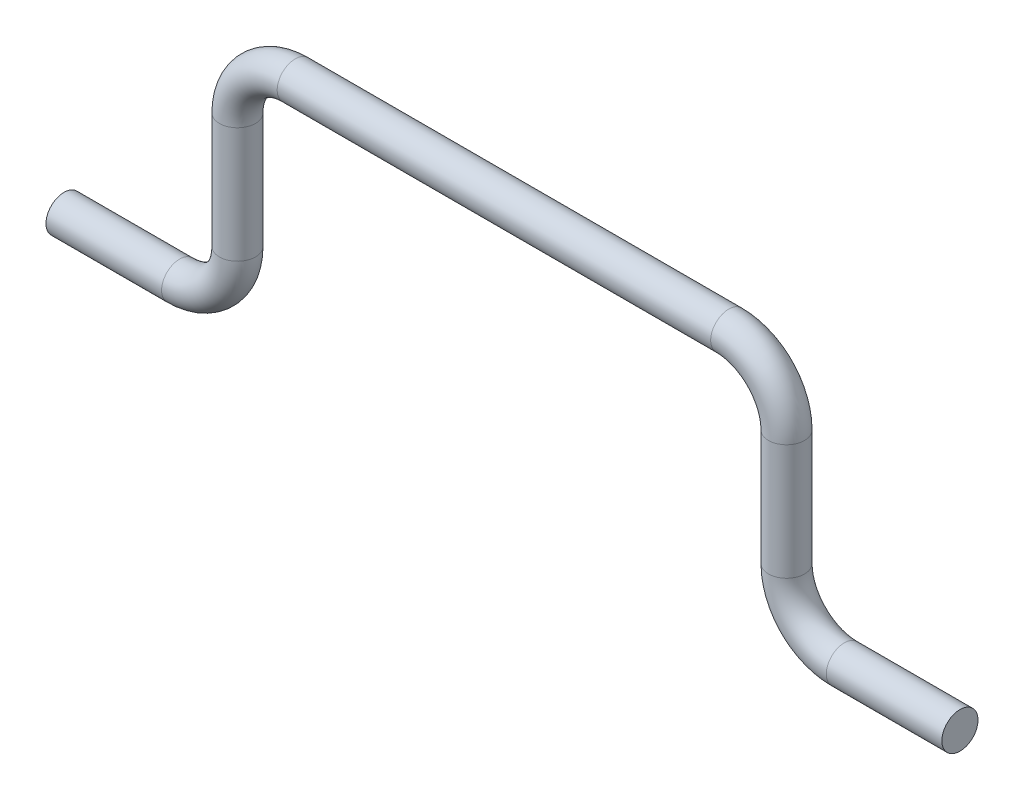
ISO-10303-21;
HEADER;
FILE_DESCRIPTION(('STEP AP214'),'2;1');
FILE_NAME('part.step','',(''),(''),'','','');
FILE_SCHEMA(('AUTOMOTIVE_DESIGN { 1 0 10303 214 1 1 1 1 }'));
ENDSEC;
DATA;
#1=APPLICATION_CONTEXT('core data for automotive mechanical design processes');
#2=APPLICATION_PROTOCOL_DEFINITION('international standard','automotive_design',2000,#1);
#3=PRODUCT_CONTEXT('',#1,'mechanical');
#4=PRODUCT('Part','Part','',(#3));
#5=PRODUCT_RELATED_PRODUCT_CATEGORY('part','',(#4));
#6=PRODUCT_DEFINITION_FORMATION('','',#4);
#7=PRODUCT_DEFINITION_CONTEXT('part definition',#1,'design');
#8=PRODUCT_DEFINITION('design','',#6,#7);
#9=PRODUCT_DEFINITION_SHAPE('','',#8);
#10=(LENGTH_UNIT() NAMED_UNIT(*) SI_UNIT(.MILLI.,.METRE.));
#11=(NAMED_UNIT(*) PLANE_ANGLE_UNIT() SI_UNIT($,.RADIAN.));
#12=(NAMED_UNIT(*) SI_UNIT($,.STERADIAN.) SOLID_ANGLE_UNIT());
#13=UNCERTAINTY_MEASURE_WITH_UNIT(LENGTH_MEASURE(1.E-05),#10,'distance_accuracy_value','');
#14=(GEOMETRIC_REPRESENTATION_CONTEXT(3) GLOBAL_UNCERTAINTY_ASSIGNED_CONTEXT((#13)) GLOBAL_UNIT_ASSIGNED_CONTEXT((#10,
#11,#12)) REPRESENTATION_CONTEXT('',''));
#15=CARTESIAN_POINT('',(0.,0.,0.));
#16=DIRECTION('',(0.,0.,1.));
#17=DIRECTION('',(1.,0.,0.));
#18=AXIS2_PLACEMENT_3D('',#15,#16,#17);
#19=CARTESIAN_POINT('',(196.85,0.,0.));
#20=DIRECTION('',(1.,0.,0.));
#21=DIRECTION('',(0.,0.,-1.));
#22=AXIS2_PLACEMENT_3D('',#19,#20,#21);
#23=PLANE('',#22);
#24=CARTESIAN_POINT('',(196.85,0.,0.));
#25=DIRECTION('',(1.,0.,0.));
#26=DIRECTION('',(0.,0.,-1.));
#27=AXIS2_PLACEMENT_3D('',#24,#25,#26);
#28=CIRCLE('',#27,3.96875);
#29=CARTESIAN_POINT('',(196.85,0.,-3.96875));
#30=VERTEX_POINT('',#29);
#31=EDGE_CURVE('E86',#30,#30,#28,.T.);
#32=ORIENTED_EDGE('',*,*,#31,.T.);
#33=EDGE_LOOP('',(#32));
#34=FACE_BOUND('',#33,.T.);
#35=ADVANCED_FACE('F43',(#34),#23,.T.);
#36=CARTESIAN_POINT('',(0.,0.,0.));
#37=DIRECTION('',(1.,0.,0.));
#38=DIRECTION('',(0.,0.,-1.));
#39=AXIS2_PLACEMENT_3D('',#36,#37,#38);
#40=PLANE('',#39);
#41=CARTESIAN_POINT('',(0.,0.,0.));
#42=DIRECTION('',(1.,0.,0.));
#43=DIRECTION('',(0.,0.,-1.));
#44=AXIS2_PLACEMENT_3D('',#41,#42,#43);
#45=CIRCLE('',#44,3.96875);
#46=CARTESIAN_POINT('',(0.,0.,-3.96875));
#47=VERTEX_POINT('',#46);
#48=EDGE_CURVE('E10',#47,#47,#45,.T.);
#49=ORIENTED_EDGE('',*,*,#48,.F.);
#50=EDGE_LOOP('',(#49));
#51=FACE_BOUND('',#50,.T.);
#52=ADVANCED_FACE('F95',(#51),#40,.F.);
#53=CARTESIAN_POINT('',(196.85,0.,0.));
#54=DIRECTION('',(-1.,0.,0.));
#55=DIRECTION('',(0.,-1.,0.));
#56=AXIS2_PLACEMENT_3D('',#53,#54,#55);
#57=CYLINDRICAL_SURFACE('',#56,3.96875);
#58=CARTESIAN_POINT('',(171.45,0.,0.));
#59=DIRECTION('',(1.,0.,0.));
#60=DIRECTION('',(0.,0.,-1.));
#61=AXIS2_PLACEMENT_3D('',#58,#59,#60);
#62=CIRCLE('',#61,3.96875);
#63=CARTESIAN_POINT('',(171.45,-3.96874999999998,0.));
#64=VERTEX_POINT('',#63);
#65=EDGE_CURVE('E82',#64,#64,#62,.T.);
#66=ORIENTED_EDGE('',*,*,#65,.T.);
#67=EDGE_LOOP('',(#66));
#68=FACE_BOUND('',#67,.T.);
#69=ORIENTED_EDGE('',*,*,#31,.F.);
#70=EDGE_LOOP('',(#69));
#71=FACE_BOUND('',#70,.T.);
#72=ADVANCED_FACE('F92',(#68,#71),#57,.T.);
#73=CARTESIAN_POINT('',(171.45,12.7,0.));
#74=DIRECTION('',(0.,0.,-1.));
#75=DIRECTION('',(-1.,0.,0.));
#76=AXIS2_PLACEMENT_3D('',#73,#74,#75);
#77=TOROIDAL_SURFACE('',#76,12.7,3.96875);
#78=CARTESIAN_POINT('',(158.75,12.7,0.));
#79=DIRECTION('',(0.,-1.,0.));
#80=DIRECTION('',(0.,0.,-1.));
#81=AXIS2_PLACEMENT_3D('',#78,#79,#80);
#82=CIRCLE('',#81,3.96875);
#83=CARTESIAN_POINT('',(154.78125,12.7,0.));
#84=VERTEX_POINT('',#83);
#85=EDGE_CURVE('E78',#84,#84,#82,.T.);
#86=CARTESIAN_POINT('',(171.45,12.7,0.));
#87=DIRECTION('',(0.,0.,-1.));
#88=DIRECTION('',(-1.,0.,0.));
#89=AXIS2_PLACEMENT_3D('',#86,#87,#88);
#90=CIRCLE('',#89,16.66875);
#91=EDGE_CURVE('',#64,#84,#90,.T.);
#92=ORIENTED_EDGE('',*,*,#65,.F.);
#93=ORIENTED_EDGE('',*,*,#85,.T.);
#94=ORIENTED_EDGE('',*,*,#91,.T.);
#95=ORIENTED_EDGE('',*,*,#91,.F.);
#96=EDGE_LOOP('',(#92,#94,#93,#95));
#97=FACE_BOUND('',#96,.T.);
#98=ADVANCED_FACE('F94',(#97),#77,.T.);
#99=CARTESIAN_POINT('',(158.75,12.7000000000001,0.));
#100=DIRECTION('',(0.,1.,0.));
#101=DIRECTION('',(0.,0.,1.));
#102=AXIS2_PLACEMENT_3D('',#99,#100,#101);
#103=CYLINDRICAL_SURFACE('',#102,3.96875);
#104=CARTESIAN_POINT('',(158.75,38.0999999999999,0.));
#105=DIRECTION('',(0.,-1.,0.));
#106=DIRECTION('',(0.,0.,-1.));
#107=AXIS2_PLACEMENT_3D('',#104,#105,#106);
#108=CIRCLE('',#107,3.96875);
#109=CARTESIAN_POINT('',(162.71875,38.0999999999999,0.));
#110=VERTEX_POINT('',#109);
#111=EDGE_CURVE('E74',#110,#110,#108,.T.);
#112=ORIENTED_EDGE('',*,*,#111,.T.);
#113=EDGE_LOOP('',(#112));
#114=FACE_BOUND('',#113,.T.);
#115=ORIENTED_EDGE('',*,*,#85,.F.);
#116=EDGE_LOOP('',(#115));
#117=FACE_BOUND('',#116,.T.);
#118=ADVANCED_FACE('F102',(#114,#117),#103,.T.);
#119=CARTESIAN_POINT('',(146.05,38.1,0.));
#120=DIRECTION('',(0.,0.,1.));
#121=DIRECTION('',(1.,0.,0.));
#122=AXIS2_PLACEMENT_3D('',#119,#120,#121);
#123=TOROIDAL_SURFACE('',#122,12.7,3.96875);
#124=CARTESIAN_POINT('',(146.05,50.8,0.));
#125=DIRECTION('',(1.,0.,0.));
#126=DIRECTION('',(0.,0.,-1.));
#127=AXIS2_PLACEMENT_3D('',#124,#125,#126);
#128=CIRCLE('',#127,3.96875);
#129=CARTESIAN_POINT('',(146.05,54.76875,0.));
#130=VERTEX_POINT('',#129);
#131=EDGE_CURVE('E70',#130,#130,#128,.T.);
#132=CARTESIAN_POINT('',(146.05,38.1,0.));
#133=DIRECTION('',(0.,0.,1.));
#134=DIRECTION('',(1.,0.,0.));
#135=AXIS2_PLACEMENT_3D('',#132,#133,#134);
#136=CIRCLE('',#135,16.66875);
#137=EDGE_CURVE('',#110,#130,#136,.T.);
#138=ORIENTED_EDGE('',*,*,#111,.F.);
#139=ORIENTED_EDGE('',*,*,#131,.T.);
#140=ORIENTED_EDGE('',*,*,#137,.T.);
#141=ORIENTED_EDGE('',*,*,#137,.F.);
#142=EDGE_LOOP('',(#138,#140,#139,#141));
#143=FACE_BOUND('',#142,.T.);
#144=ADVANCED_FACE('F127',(#143),#123,.T.);
#145=CARTESIAN_POINT('',(146.05,50.8,0.));
#146=DIRECTION('',(-1.,0.,0.));
#147=DIRECTION('',(0.,-1.,0.));
#148=AXIS2_PLACEMENT_3D('',#145,#146,#147);
#149=CYLINDRICAL_SURFACE('',#148,3.96875);
#150=CARTESIAN_POINT('',(50.8000000000001,50.8,0.));
#151=DIRECTION('',(1.,0.,0.));
#152=DIRECTION('',(0.,0.,-1.));
#153=AXIS2_PLACEMENT_3D('',#150,#151,#152);
#154=CIRCLE('',#153,3.96875);
#155=CARTESIAN_POINT('',(50.8000000000001,54.76875,0.));
#156=VERTEX_POINT('',#155);
#157=EDGE_CURVE('E66',#156,#156,#154,.T.);
#158=ORIENTED_EDGE('',*,*,#157,.T.);
#159=EDGE_LOOP('',(#158));
#160=FACE_BOUND('',#159,.T.);
#161=ORIENTED_EDGE('',*,*,#131,.F.);
#162=EDGE_LOOP('',(#161));
#163=FACE_BOUND('',#162,.T.);
#164=ADVANCED_FACE('F123',(#160,#163),#149,.T.);
#165=CARTESIAN_POINT('',(50.8,38.1,0.));
#166=DIRECTION('',(0.,0.,1.));
#167=DIRECTION('',(1.,0.,0.));
#168=AXIS2_PLACEMENT_3D('',#165,#166,#167);
#169=TOROIDAL_SURFACE('',#168,12.7,3.96875);
#170=CARTESIAN_POINT('',(38.1,38.0999999999999,0.));
#171=DIRECTION('',(0.,1.,0.));
#172=DIRECTION('',(0.,0.,-1.));
#173=AXIS2_PLACEMENT_3D('',#170,#171,#172);
#174=CIRCLE('',#173,3.96875);
#175=CARTESIAN_POINT('',(34.13125,38.0999999999999,0.));
#176=VERTEX_POINT('',#175);
#177=EDGE_CURVE('E60',#176,#176,#174,.T.);
#178=CARTESIAN_POINT('',(50.8,38.1,0.));
#179=DIRECTION('',(0.,0.,1.));
#180=DIRECTION('',(1.,0.,0.));
#181=AXIS2_PLACEMENT_3D('',#178,#179,#180);
#182=CIRCLE('',#181,16.66875);
#183=EDGE_CURVE('',#156,#176,#182,.T.);
#184=ORIENTED_EDGE('',*,*,#157,.F.);
#185=ORIENTED_EDGE('',*,*,#177,.T.);
#186=ORIENTED_EDGE('',*,*,#183,.T.);
#187=ORIENTED_EDGE('',*,*,#183,.F.);
#188=EDGE_LOOP('',(#184,#186,#185,#187));
#189=FACE_BOUND('',#188,.T.);
#190=ADVANCED_FACE('F119',(#189),#169,.T.);
#191=CARTESIAN_POINT('',(38.1,38.0999999999999,0.));
#192=DIRECTION('',(0.,-1.,0.));
#193=DIRECTION('',(0.,0.,-1.));
#194=AXIS2_PLACEMENT_3D('',#191,#192,#193);
#195=CYLINDRICAL_SURFACE('',#194,3.96875);
#196=CARTESIAN_POINT('',(38.1,12.7000000000001,0.));
#197=DIRECTION('',(0.,1.,0.));
#198=DIRECTION('',(0.,0.,-1.));
#199=AXIS2_PLACEMENT_3D('',#196,#197,#198);
#200=CIRCLE('',#199,3.96875);
#201=CARTESIAN_POINT('',(42.06875,12.7000000000001,0.));
#202=VERTEX_POINT('',#201);
#203=EDGE_CURVE('E55',#202,#202,#200,.T.);
#204=ORIENTED_EDGE('',*,*,#203,.T.);
#205=EDGE_LOOP('',(#204));
#206=FACE_BOUND('',#205,.T.);
#207=ORIENTED_EDGE('',*,*,#177,.F.);
#208=EDGE_LOOP('',(#207));
#209=FACE_BOUND('',#208,.T.);
#210=ADVANCED_FACE('F113',(#206,#209),#195,.T.);
#211=CARTESIAN_POINT('',(25.4,12.7,0.));
#212=DIRECTION('',(0.,0.,-1.));
#213=DIRECTION('',(-1.,0.,0.));
#214=AXIS2_PLACEMENT_3D('',#211,#212,#213);
#215=TOROIDAL_SURFACE('',#214,12.7,3.96875);
#216=CARTESIAN_POINT('',(25.3999999999999,0.,0.));
#217=DIRECTION('',(1.,0.,0.));
#218=DIRECTION('',(0.,0.,-1.));
#219=AXIS2_PLACEMENT_3D('',#216,#217,#218);
#220=CIRCLE('',#219,3.96875);
#221=CARTESIAN_POINT('',(25.3999999999999,-3.96875,0.));
#222=VERTEX_POINT('',#221);
#223=EDGE_CURVE('E50',#222,#222,#220,.T.);
#224=CARTESIAN_POINT('',(25.4,12.7,0.));
#225=DIRECTION('',(0.,0.,-1.));
#226=DIRECTION('',(-1.,0.,0.));
#227=AXIS2_PLACEMENT_3D('',#224,#225,#226);
#228=CIRCLE('',#227,16.66875);
#229=EDGE_CURVE('',#202,#222,#228,.T.);
#230=ORIENTED_EDGE('',*,*,#203,.F.);
#231=ORIENTED_EDGE('',*,*,#223,.T.);
#232=ORIENTED_EDGE('',*,*,#229,.T.);
#233=ORIENTED_EDGE('',*,*,#229,.F.);
#234=EDGE_LOOP('',(#230,#232,#231,#233));
#235=FACE_BOUND('',#234,.T.);
#236=ADVANCED_FACE('F108',(#235),#215,.T.);
#237=CARTESIAN_POINT('',(25.3999999999999,0.,0.));
#238=DIRECTION('',(-1.,0.,0.));
#239=DIRECTION('',(0.,0.,1.));
#240=AXIS2_PLACEMENT_3D('',#237,#238,#239);
#241=CYLINDRICAL_SURFACE('',#240,3.96875);
#242=ORIENTED_EDGE('',*,*,#48,.T.);
#243=EDGE_LOOP('',(#242));
#244=FACE_BOUND('',#243,.T.);
#245=ORIENTED_EDGE('',*,*,#223,.F.);
#246=EDGE_LOOP('',(#245));
#247=FACE_BOUND('',#246,.T.);
#248=ADVANCED_FACE('F106',(#244,#247),#241,.T.);
#249=CLOSED_SHELL('',(#35,#52,#72,#98,#118,#144,#164,#190,#210,#236,#248));
#250=MANIFOLD_SOLID_BREP('B2',#249);
#251=ADVANCED_BREP_SHAPE_REPRESENTATION('',(#18,#250),#14);
#252=SHAPE_DEFINITION_REPRESENTATION(#9,#251);
ENDSEC;
END-ISO-10303-21;
